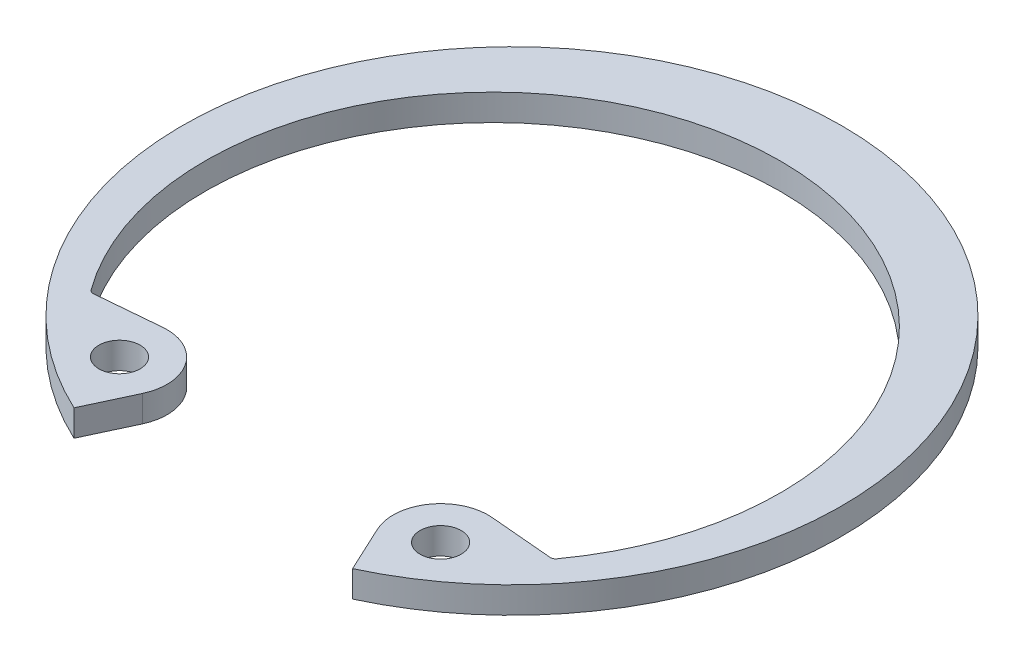
ISO-10303-21;
HEADER;
FILE_DESCRIPTION(('STEP AP214'),'2;1');
FILE_NAME('part.step','',(''),(''),'','','');
FILE_SCHEMA(('AUTOMOTIVE_DESIGN { 1 0 10303 214 1 1 1 1 }'));
ENDSEC;
DATA;
#1=APPLICATION_CONTEXT('core data for automotive mechanical design processes');
#2=APPLICATION_PROTOCOL_DEFINITION('international standard','automotive_design',2000,#1);
#3=PRODUCT_CONTEXT('',#1,'mechanical');
#4=PRODUCT('Part','Part','',(#3));
#5=PRODUCT_RELATED_PRODUCT_CATEGORY('part','',(#4));
#6=PRODUCT_DEFINITION_FORMATION('','',#4);
#7=PRODUCT_DEFINITION_CONTEXT('part definition',#1,'design');
#8=PRODUCT_DEFINITION('design','',#6,#7);
#9=PRODUCT_DEFINITION_SHAPE('','',#8);
#10=(LENGTH_UNIT() NAMED_UNIT(*) SI_UNIT(.MILLI.,.METRE.));
#11=(NAMED_UNIT(*) PLANE_ANGLE_UNIT() SI_UNIT($,.RADIAN.));
#12=(NAMED_UNIT(*) SI_UNIT($,.STERADIAN.) SOLID_ANGLE_UNIT());
#13=UNCERTAINTY_MEASURE_WITH_UNIT(LENGTH_MEASURE(1.E-05),#10,'distance_accuracy_value','');
#14=(GEOMETRIC_REPRESENTATION_CONTEXT(3) GLOBAL_UNCERTAINTY_ASSIGNED_CONTEXT((#13)) GLOBAL_UNIT_ASSIGNED_CONTEXT((#10,
#11,#12)) REPRESENTATION_CONTEXT('',''));
#15=CARTESIAN_POINT('',(0.,0.,0.));
#16=DIRECTION('',(0.,0.,1.));
#17=DIRECTION('',(1.,0.,0.));
#18=AXIS2_PLACEMENT_3D('',#15,#16,#17);
#19=CARTESIAN_POINT('',(7.72748984788551,-1.27,11.1625186378714));
#20=DIRECTION('',(0.,1.,0.));
#21=DIRECTION('',(0.,0.,1.));
#22=AXIS2_PLACEMENT_3D('',#19,#20,#21);
#23=CYLINDRICAL_SURFACE('',#22,2.28599999999999);
#24=CARTESIAN_POINT('',(7.72748984788551,0.,11.1625186378714));
#25=DIRECTION('',(0.,1.,0.));
#26=DIRECTION('',(0.,0.,-1.));
#27=AXIS2_PLACEMENT_3D('',#24,#25,#26);
#28=CIRCLE('',#27,2.28599999999999);
#29=CARTESIAN_POINT('',(7.92672787580667,0.,8.88521755803369));
#30=VERTEX_POINT('',#29);
#31=CARTESIAN_POINT('',(5.65567024671972,0.,12.1286239842106));
#32=VERTEX_POINT('',#31);
#33=EDGE_CURVE('E143',#30,#32,#28,.T.);
#34=ORIENTED_EDGE('',*,*,#33,.F.);
#35=DIRECTION('',(0.,1.,0.));
#36=VECTOR('',#35,1.);
#37=CARTESIAN_POINT('',(7.92672787580667,-1.27,8.88521755803369));
#38=LINE('',#37,#36);
#39=CARTESIAN_POINT('',(7.92672787580667,-1.27,8.88521755803369));
#40=VERTEX_POINT('',#39);
#41=EDGE_CURVE('E219',#40,#30,#38,.T.);
#42=ORIENTED_EDGE('',*,*,#41,.F.);
#43=CARTESIAN_POINT('',(7.72748984788551,-1.27,11.1625186378714));
#44=DIRECTION('',(0.,1.,0.));
#45=DIRECTION('',(0.,0.,-1.));
#46=AXIS2_PLACEMENT_3D('',#43,#44,#45);
#47=CIRCLE('',#46,2.28599999999999);
#48=CARTESIAN_POINT('',(5.65567024671972,-1.27,12.1286239842106));
#49=VERTEX_POINT('',#48);
#50=EDGE_CURVE('E145',#40,#49,#47,.T.);
#51=ORIENTED_EDGE('',*,*,#50,.T.);
#52=DIRECTION('',(0.,1.,0.));
#53=VECTOR('',#52,1.);
#54=CARTESIAN_POINT('',(5.65567024671972,-1.27,12.1286239842106));
#55=LINE('',#54,#53);
#56=EDGE_CURVE('E139',#49,#32,#55,.T.);
#57=ORIENTED_EDGE('',*,*,#56,.T.);
#58=EDGE_LOOP('',(#34,#42,#51,#57));
#59=FACE_BOUND('',#58,.T.);
#60=ADVANCED_FACE('F44',(#59),#23,.T.);
#61=CARTESIAN_POINT('',(11.1256040131855,-1.27,9.16508295607794));
#62=DIRECTION('',(0.08715574274766,0.,-0.996194698091745));
#63=DIRECTION('',(-0.996194698091746,0.,-0.08715574274766));
#64=AXIS2_PLACEMENT_3D('',#61,#62,#63);
#65=PLANE('',#64);
#66=DIRECTION('',(-0.996194698091745,0.,-0.08715574274766));
#67=VECTOR('',#66,1.);
#68=CARTESIAN_POINT('',(11.1256040131855,0.,9.16508295607794));
#69=LINE('',#68,#67);
#70=CARTESIAN_POINT('',(10.983084144875,0.,9.15261408327356));
#71=VERTEX_POINT('',#70);
#72=EDGE_CURVE('E162',#71,#30,#69,.T.);
#73=ORIENTED_EDGE('',*,*,#72,.F.);
#74=DIRECTION('',(0.,-1.,0.));
#75=VECTOR('',#74,1.);
#76=CARTESIAN_POINT('',(10.983084144875,-1.27,9.15261408327356));
#77=LINE('',#76,#75);
#78=CARTESIAN_POINT('',(10.983084144875,-1.27,9.15261408327356));
#79=VERTEX_POINT('',#78);
#80=EDGE_CURVE('E62',#71,#79,#77,.T.);
#81=ORIENTED_EDGE('',*,*,#80,.T.);
#82=DIRECTION('',(-0.996194698091745,0.,-0.08715574274766));
#83=VECTOR('',#82,1.);
#84=CARTESIAN_POINT('',(11.1256040131855,-1.27,9.16508295607794));
#85=LINE('',#84,#83);
#86=EDGE_CURVE('E151',#79,#40,#85,.T.);
#87=ORIENTED_EDGE('',*,*,#86,.T.);
#88=ORIENTED_EDGE('',*,*,#41,.T.);
#89=EDGE_LOOP('',(#73,#81,#87,#88));
#90=FACE_BOUND('',#89,.T.);
#91=ADVANCED_FACE('F282',(#90),#65,.T.);
#92=CARTESIAN_POINT('',(0.,-1.27,0.927434650927232));
#93=DIRECTION('',(0.,1.,0.));
#94=DIRECTION('',(0.,0.,1.));
#95=AXIS2_PLACEMENT_3D('',#92,#93,#94);
#96=CYLINDRICAL_SURFACE('',#95,13.8433346509272);
#97=CARTESIAN_POINT('',(0.,0.,0.927434650927232));
#98=DIRECTION('',(0.,-1.,0.));
#99=DIRECTION('',(0.,0.,1.));
#100=AXIS2_PLACEMENT_3D('',#97,#98,#99);
#101=CIRCLE('',#100,13.8433346509272);
#102=CARTESIAN_POINT('',(-11.2109217164107,0.,9.04858903476162));
#103=VERTEX_POINT('',#102);
#104=CARTESIAN_POINT('',(11.2109217164107,0.,9.04858903476163));
#105=VERTEX_POINT('',#104);
#106=EDGE_CURVE('E187',#103,#105,#101,.T.);
#107=ORIENTED_EDGE('',*,*,#106,.F.);
#108=DIRECTION('',(0.,1.,0.));
#109=VECTOR('',#108,1.);
#110=CARTESIAN_POINT('',(-11.2109217164107,-1.27,9.04858903476162));
#111=LINE('',#110,#109);
#112=CARTESIAN_POINT('',(-11.2109217164107,-1.27,9.04858903476162));
#113=VERTEX_POINT('',#112);
#114=EDGE_CURVE('E241',#103,#113,#111,.F.);
#115=ORIENTED_EDGE('',*,*,#114,.T.);
#116=CARTESIAN_POINT('',(0.,-1.27,0.927434650927232));
#117=DIRECTION('',(0.,-1.,0.));
#118=DIRECTION('',(0.,0.,1.));
#119=AXIS2_PLACEMENT_3D('',#116,#117,#118);
#120=CIRCLE('',#119,13.8433346509272);
#121=CARTESIAN_POINT('',(11.2109217164107,-1.27,9.04858903476163));
#122=VERTEX_POINT('',#121);
#123=EDGE_CURVE('E213',#113,#122,#120,.T.);
#124=ORIENTED_EDGE('',*,*,#123,.T.);
#125=DIRECTION('',(0.,1.,0.));
#126=VECTOR('',#125,1.);
#127=CARTESIAN_POINT('',(11.2109217164107,-1.27,9.04858903476163));
#128=LINE('',#127,#126);
#129=EDGE_CURVE('E237',#122,#105,#128,.T.);
#130=ORIENTED_EDGE('',*,*,#129,.T.);
#131=EDGE_LOOP('',(#107,#115,#124,#130));
#132=FACE_BOUND('',#131,.T.);
#133=ADVANCED_FACE('F286',(#132),#96,.F.);
#134=CARTESIAN_POINT('',(-11.1256040131855,-1.27,9.16508295607793));
#135=DIRECTION('',(-0.08715574274766,0.,-0.996194698091745));
#136=DIRECTION('',(-0.996194698091746,0.,0.08715574274766));
#137=AXIS2_PLACEMENT_3D('',#134,#135,#136);
#138=PLANE('',#137);
#139=DIRECTION('',(-0.996194698091745,0.,0.08715574274766));
#140=VECTOR('',#139,1.);
#141=CARTESIAN_POINT('',(-11.1256040131855,-1.27,9.16508295607793));
#142=LINE('',#141,#140);
#143=CARTESIAN_POINT('',(-7.92672787580665,-1.27,8.88521755803368));
#144=VERTEX_POINT('',#143);
#145=CARTESIAN_POINT('',(-10.983084144875,-1.27,9.15261408327355));
#146=VERTEX_POINT('',#145);
#147=EDGE_CURVE('E209',#144,#146,#142,.T.);
#148=ORIENTED_EDGE('',*,*,#147,.T.);
#149=DIRECTION('',(0.,-1.,0.));
#150=VECTOR('',#149,1.);
#151=CARTESIAN_POINT('',(-10.983084144875,0.,9.15261408327355));
#152=LINE('',#151,#150);
#153=CARTESIAN_POINT('',(-10.983084144875,0.,9.15261408327355));
#154=VERTEX_POINT('',#153);
#155=EDGE_CURVE('E222',#146,#154,#152,.F.);
#156=ORIENTED_EDGE('',*,*,#155,.T.);
#157=DIRECTION('',(-0.996194698091745,0.,0.08715574274766));
#158=VECTOR('',#157,1.);
#159=CARTESIAN_POINT('',(-11.1256040131855,0.,9.16508295607793));
#160=LINE('',#159,#158);
#161=CARTESIAN_POINT('',(-7.92672787580665,0.,8.88521755803368));
#162=VERTEX_POINT('',#161);
#163=EDGE_CURVE('E183',#162,#154,#160,.T.);
#164=ORIENTED_EDGE('',*,*,#163,.F.);
#165=DIRECTION('',(0.,1.,0.));
#166=VECTOR('',#165,1.);
#167=CARTESIAN_POINT('',(-7.92672787580665,-1.27,8.88521755803368));
#168=LINE('',#167,#166);
#169=EDGE_CURVE('E223',#144,#162,#168,.T.);
#170=ORIENTED_EDGE('',*,*,#169,.F.);
#171=EDGE_LOOP('',(#148,#156,#164,#170));
#172=FACE_BOUND('',#171,.T.);
#173=ADVANCED_FACE('F291',(#172),#138,.T.);
#174=CARTESIAN_POINT('',(-7.72748984788551,-1.27,11.1625186378714));
#175=DIRECTION('',(0.,1.,0.));
#176=DIRECTION('',(0.,0.,1.));
#177=AXIS2_PLACEMENT_3D('',#174,#175,#176);
#178=CYLINDRICAL_SURFACE('',#177,2.286);
#179=CARTESIAN_POINT('',(-7.72748984788551,0.,11.1625186378714));
#180=DIRECTION('',(0.,1.,0.));
#181=DIRECTION('',(0.,0.,1.));
#182=AXIS2_PLACEMENT_3D('',#179,#180,#181);
#183=CIRCLE('',#182,2.286);
#184=CARTESIAN_POINT('',(-5.65567024671972,0.,12.1286239842106));
#185=VERTEX_POINT('',#184);
#186=EDGE_CURVE('E179',#185,#162,#183,.T.);
#187=ORIENTED_EDGE('',*,*,#186,.F.);
#188=DIRECTION('',(0.,1.,0.));
#189=VECTOR('',#188,1.);
#190=CARTESIAN_POINT('',(-5.65567024671972,-1.27,12.1286239842106));
#191=LINE('',#190,#189);
#192=CARTESIAN_POINT('',(-5.65567024671972,-1.27,12.1286239842106));
#193=VERTEX_POINT('',#192);
#194=EDGE_CURVE('E226',#193,#185,#191,.T.);
#195=ORIENTED_EDGE('',*,*,#194,.F.);
#196=CARTESIAN_POINT('',(-7.72748984788551,-1.27,11.1625186378714));
#197=DIRECTION('',(0.,1.,0.));
#198=DIRECTION('',(0.,0.,1.));
#199=AXIS2_PLACEMENT_3D('',#196,#197,#198);
#200=CIRCLE('',#199,2.286);
#201=EDGE_CURVE('E205',#193,#144,#200,.T.);
#202=ORIENTED_EDGE('',*,*,#201,.T.);
#203=ORIENTED_EDGE('',*,*,#169,.T.);
#204=EDGE_LOOP('',(#187,#195,#202,#203));
#205=FACE_BOUND('',#204,.T.);
#206=ADVANCED_FACE('F297',(#205),#178,.T.);
#207=CARTESIAN_POINT('',(-6.70369765320941,-1.27,14.3761260103115));
#208=DIRECTION('',(0.906307787036652,0.,0.422618261740694));
#209=DIRECTION('',(0.422618261740694,0.,-0.906307787036652));
#210=AXIS2_PLACEMENT_3D('',#207,#208,#209);
#211=PLANE('',#210);
#212=DIRECTION('',(0.422618261740694,0.,-0.906307787036652));
#213=VECTOR('',#212,1.);
#214=CARTESIAN_POINT('',(-6.70369765320941,0.,14.3761260103115));
#215=LINE('',#214,#213);
#216=CARTESIAN_POINT('',(-6.70369765320942,0.,14.3761260103115));
#217=VERTEX_POINT('',#216);
#218=EDGE_CURVE('E175',#217,#185,#215,.T.);
#219=ORIENTED_EDGE('',*,*,#218,.F.);
#220=DIRECTION('',(0.,1.,0.));
#221=VECTOR('',#220,1.);
#222=CARTESIAN_POINT('',(-6.70369765320942,-1.27,14.3761260103115));
#223=LINE('',#222,#221);
#224=CARTESIAN_POINT('',(-6.70369765320942,-1.27,14.3761260103115));
#225=VERTEX_POINT('',#224);
#226=EDGE_CURVE('E229',#225,#217,#223,.T.);
#227=ORIENTED_EDGE('',*,*,#226,.F.);
#228=DIRECTION('',(0.422618261740694,0.,-0.906307787036652));
#229=VECTOR('',#228,1.);
#230=CARTESIAN_POINT('',(-6.70369765320941,-1.27,14.3761260103115));
#231=LINE('',#230,#229);
#232=EDGE_CURVE('E201',#225,#193,#231,.T.);
#233=ORIENTED_EDGE('',*,*,#232,.T.);
#234=ORIENTED_EDGE('',*,*,#194,.T.);
#235=EDGE_LOOP('',(#219,#227,#233,#234));
#236=FACE_BOUND('',#235,.T.);
#237=ADVANCED_FACE('F301',(#236),#211,.T.);
#238=CARTESIAN_POINT('',(0.,-1.27,0.));
#239=DIRECTION('',(0.,1.,0.));
#240=DIRECTION('',(0.,0.,1.));
#241=AXIS2_PLACEMENT_3D('',#238,#239,#240);
#242=CYLINDRICAL_SURFACE('',#241,15.8623);
#243=CARTESIAN_POINT('',(0.,0.,0.));
#244=DIRECTION('',(0.,1.,0.));
#245=DIRECTION('',(0.,0.,1.));
#246=AXIS2_PLACEMENT_3D('',#243,#244,#245);
#247=CIRCLE('',#246,15.8623);
#248=CARTESIAN_POINT('',(6.70369765320941,0.,14.3761260103115));
#249=VERTEX_POINT('',#248);
#250=EDGE_CURVE('E159',#249,#217,#247,.T.);
#251=ORIENTED_EDGE('',*,*,#250,.F.);
#252=DIRECTION('',(0.,1.,0.));
#253=VECTOR('',#252,1.);
#254=CARTESIAN_POINT('',(6.70369765320941,-1.27,14.3761260103115));
#255=LINE('',#254,#253);
#256=CARTESIAN_POINT('',(6.70369765320941,-1.27,14.3761260103115));
#257=VERTEX_POINT('',#256);
#258=EDGE_CURVE('E150',#257,#249,#255,.T.);
#259=ORIENTED_EDGE('',*,*,#258,.F.);
#260=CARTESIAN_POINT('',(0.,-1.27,0.));
#261=DIRECTION('',(0.,1.,0.));
#262=DIRECTION('',(0.,0.,1.));
#263=AXIS2_PLACEMENT_3D('',#260,#261,#262);
#264=CIRCLE('',#263,15.8623);
#265=EDGE_CURVE('E197',#257,#225,#264,.T.);
#266=ORIENTED_EDGE('',*,*,#265,.T.);
#267=ORIENTED_EDGE('',*,*,#226,.T.);
#268=EDGE_LOOP('',(#251,#259,#266,#267));
#269=FACE_BOUND('',#268,.T.);
#270=ADVANCED_FACE('F305',(#269),#242,.T.);
#271=CARTESIAN_POINT('',(6.70369765320941,-1.27,14.3761260103115));
#272=DIRECTION('',(-0.906307787036652,0.,0.422618261740694));
#273=DIRECTION('',(0.422618261740694,0.,0.906307787036652));
#274=AXIS2_PLACEMENT_3D('',#271,#272,#273);
#275=PLANE('',#274);
#276=DIRECTION('',(0.422618261740694,0.,0.906307787036652));
#277=VECTOR('',#276,1.);
#278=CARTESIAN_POINT('',(6.70369765320941,0.,14.3761260103115));
#279=LINE('',#278,#277);
#280=EDGE_CURVE('E154',#32,#249,#279,.T.);
#281=ORIENTED_EDGE('',*,*,#280,.F.);
#282=ORIENTED_EDGE('',*,*,#56,.F.);
#283=DIRECTION('',(0.422618261740694,0.,0.906307787036652));
#284=VECTOR('',#283,1.);
#285=CARTESIAN_POINT('',(6.70369765320941,-1.27,14.3761260103115));
#286=LINE('',#285,#284);
#287=EDGE_CURVE('E194',#49,#257,#286,.T.);
#288=ORIENTED_EDGE('',*,*,#287,.T.);
#289=ORIENTED_EDGE('',*,*,#258,.T.);
#290=EDGE_LOOP('',(#281,#282,#288,#289));
#291=FACE_BOUND('',#290,.T.);
#292=ADVANCED_FACE('F155',(#291),#275,.T.);
#293=CARTESIAN_POINT('',(7.72748984788551,-1.27,11.1625186378714));
#294=DIRECTION('',(0.,-1.,0.));
#295=DIRECTION('',(0.,0.,-1.));
#296=AXIS2_PLACEMENT_3D('',#293,#294,#295);
#297=PLANE('',#296);
#298=CARTESIAN_POINT('',(-7.72748984788551,-1.27,11.1625186378714));
#299=DIRECTION('',(0.,1.,0.));
#300=DIRECTION('',(0.,0.,1.));
#301=AXIS2_PLACEMENT_3D('',#298,#299,#300);
#302=CIRCLE('',#301,0.990599999999999);
#303=CARTESIAN_POINT('',(-7.72748984788551,-1.27,12.1531186378714));
#304=VERTEX_POINT('',#303);
#305=EDGE_CURVE('E255',#304,#304,#302,.T.);
#306=ORIENTED_EDGE('',*,*,#305,.T.);
#307=EDGE_LOOP('',(#306));
#308=FACE_BOUND('',#307,.T.);
#309=CARTESIAN_POINT('',(7.7274898478855,-1.27,11.1625186378714));
#310=DIRECTION('',(0.,1.,0.));
#311=DIRECTION('',(0.,0.,1.));
#312=AXIS2_PLACEMENT_3D('',#309,#310,#311);
#313=CIRCLE('',#312,0.990599999999999);
#314=CARTESIAN_POINT('',(7.7274898478855,-1.27,12.1531186378714));
#315=VERTEX_POINT('',#314);
#316=EDGE_CURVE('E165',#315,#315,#313,.T.);
#317=ORIENTED_EDGE('',*,*,#316,.T.);
#318=EDGE_LOOP('',(#317));
#319=FACE_BOUND('',#318,.T.);
#320=ORIENTED_EDGE('',*,*,#50,.F.);
#321=ORIENTED_EDGE('',*,*,#86,.F.);
#322=CARTESIAN_POINT('',(11.0052217035329,-1.27,8.89958062995826));
#323=DIRECTION('',(0.,-1.,0.));
#324=DIRECTION('',(0.,0.,-1.));
#325=AXIS2_PLACEMENT_3D('',#322,#323,#324);
#326=CIRCLE('',#325,0.254);
#327=EDGE_CURVE('E11',#79,#122,#326,.F.);
#328=ORIENTED_EDGE('',*,*,#327,.T.);
#329=ORIENTED_EDGE('',*,*,#123,.F.);
#330=CARTESIAN_POINT('',(-11.0052217035329,-1.27,8.89958062995824));
#331=DIRECTION('',(0.,-1.,0.));
#332=DIRECTION('',(0.,0.,-1.));
#333=AXIS2_PLACEMENT_3D('',#330,#331,#332);
#334=CIRCLE('',#333,0.254);
#335=EDGE_CURVE('E249',#113,#146,#334,.F.);
#336=ORIENTED_EDGE('',*,*,#335,.T.);
#337=ORIENTED_EDGE('',*,*,#147,.F.);
#338=ORIENTED_EDGE('',*,*,#201,.F.);
#339=ORIENTED_EDGE('',*,*,#232,.F.);
#340=ORIENTED_EDGE('',*,*,#265,.F.);
#341=ORIENTED_EDGE('',*,*,#287,.F.);
#342=EDGE_LOOP('',(#320,#321,#328,#329,#336,#337,#338,#339,#340,#341));
#343=FACE_BOUND('',#342,.T.);
#344=ADVANCED_FACE('F269',(#308,#319,#343),#297,.T.);
#345=CARTESIAN_POINT('',(7.72748984788551,0.,11.1625186378714));
#346=DIRECTION('',(0.,-1.,0.));
#347=DIRECTION('',(0.,0.,-1.));
#348=AXIS2_PLACEMENT_3D('',#345,#346,#347);
#349=PLANE('',#348);
#350=CARTESIAN_POINT('',(-7.72748984788551,0.,11.1625186378714));
#351=DIRECTION('',(0.,1.,0.));
#352=DIRECTION('',(0.,0.,1.));
#353=AXIS2_PLACEMENT_3D('',#350,#351,#352);
#354=CIRCLE('',#353,0.990599999999999);
#355=CARTESIAN_POINT('',(-7.72748984788551,0.,12.1531186378714));
#356=VERTEX_POINT('',#355);
#357=EDGE_CURVE('E253',#356,#356,#354,.T.);
#358=ORIENTED_EDGE('',*,*,#357,.F.);
#359=EDGE_LOOP('',(#358));
#360=FACE_BOUND('',#359,.T.);
#361=CARTESIAN_POINT('',(7.7274898478855,0.,11.1625186378714));
#362=DIRECTION('',(0.,1.,0.));
#363=DIRECTION('',(0.,0.,1.));
#364=AXIS2_PLACEMENT_3D('',#361,#362,#363);
#365=CIRCLE('',#364,0.990599999999999);
#366=CARTESIAN_POINT('',(7.7274898478855,0.,12.1531186378714));
#367=VERTEX_POINT('',#366);
#368=EDGE_CURVE('E169',#367,#367,#365,.T.);
#369=ORIENTED_EDGE('',*,*,#368,.F.);
#370=EDGE_LOOP('',(#369));
#371=FACE_BOUND('',#370,.T.);
#372=ORIENTED_EDGE('',*,*,#33,.T.);
#373=ORIENTED_EDGE('',*,*,#280,.T.);
#374=ORIENTED_EDGE('',*,*,#250,.T.);
#375=ORIENTED_EDGE('',*,*,#218,.T.);
#376=ORIENTED_EDGE('',*,*,#186,.T.);
#377=ORIENTED_EDGE('',*,*,#163,.T.);
#378=CARTESIAN_POINT('',(-11.0052217035329,0.,8.89958062995824));
#379=DIRECTION('',(0.,-1.,0.));
#380=DIRECTION('',(0.,0.,-1.));
#381=AXIS2_PLACEMENT_3D('',#378,#379,#380);
#382=CIRCLE('',#381,0.254);
#383=EDGE_CURVE('E246',#154,#103,#382,.T.);
#384=ORIENTED_EDGE('',*,*,#383,.T.);
#385=ORIENTED_EDGE('',*,*,#106,.T.);
#386=CARTESIAN_POINT('',(11.0052217035329,0.,8.89958062995826));
#387=DIRECTION('',(0.,-1.,0.));
#388=DIRECTION('',(0.,0.,-1.));
#389=AXIS2_PLACEMENT_3D('',#386,#387,#388);
#390=CIRCLE('',#389,0.254);
#391=EDGE_CURVE('E52',#105,#71,#390,.T.);
#392=ORIENTED_EDGE('',*,*,#391,.T.);
#393=ORIENTED_EDGE('',*,*,#72,.T.);
#394=EDGE_LOOP('',(#372,#373,#374,#375,#376,#377,#384,#385,#392,#393));
#395=FACE_BOUND('',#394,.T.);
#396=ADVANCED_FACE('F161',(#360,#371,#395),#349,.F.);
#397=CARTESIAN_POINT('',(7.7274898478855,-1.27,11.1625186378714));
#398=DIRECTION('',(0.,1.,0.));
#399=DIRECTION('',(0.,0.,1.));
#400=AXIS2_PLACEMENT_3D('',#397,#398,#399);
#401=CYLINDRICAL_SURFACE('',#400,0.990599999999999);
#402=ORIENTED_EDGE('',*,*,#316,.F.);
#403=EDGE_LOOP('',(#402));
#404=FACE_BOUND('',#403,.T.);
#405=ORIENTED_EDGE('',*,*,#368,.T.);
#406=EDGE_LOOP('',(#405));
#407=FACE_BOUND('',#406,.T.);
#408=ADVANCED_FACE('F266',(#404,#407),#401,.F.);
#409=CARTESIAN_POINT('',(-7.72748984788551,-1.27,11.1625186378714));
#410=DIRECTION('',(0.,1.,0.));
#411=DIRECTION('',(0.,0.,1.));
#412=AXIS2_PLACEMENT_3D('',#409,#410,#411);
#413=CYLINDRICAL_SURFACE('',#412,0.990599999999999);
#414=ORIENTED_EDGE('',*,*,#305,.F.);
#415=EDGE_LOOP('',(#414));
#416=FACE_BOUND('',#415,.T.);
#417=ORIENTED_EDGE('',*,*,#357,.T.);
#418=EDGE_LOOP('',(#417));
#419=FACE_BOUND('',#418,.T.);
#420=ADVANCED_FACE('F276',(#416,#419),#413,.F.);
#421=CARTESIAN_POINT('',(-11.0052217035329,-1.27,8.89958062995824));
#422=DIRECTION('',(0.,1.,0.));
#423=DIRECTION('',(0.,0.,1.));
#424=AXIS2_PLACEMENT_3D('',#421,#422,#423);
#425=CYLINDRICAL_SURFACE('',#424,0.254);
#426=ORIENTED_EDGE('',*,*,#335,.F.);
#427=ORIENTED_EDGE('',*,*,#114,.F.);
#428=ORIENTED_EDGE('',*,*,#383,.F.);
#429=ORIENTED_EDGE('',*,*,#155,.F.);
#430=EDGE_LOOP('',(#426,#427,#428,#429));
#431=FACE_BOUND('',#430,.T.);
#432=ADVANCED_FACE('F399',(#431),#425,.F.);
#433=CARTESIAN_POINT('',(11.0052217035329,-1.27,8.89958062995826));
#434=DIRECTION('',(0.,1.,0.));
#435=DIRECTION('',(0.,0.,1.));
#436=AXIS2_PLACEMENT_3D('',#433,#434,#435);
#437=CYLINDRICAL_SURFACE('',#436,0.254);
#438=ORIENTED_EDGE('',*,*,#327,.F.);
#439=ORIENTED_EDGE('',*,*,#80,.F.);
#440=ORIENTED_EDGE('',*,*,#391,.F.);
#441=ORIENTED_EDGE('',*,*,#129,.F.);
#442=EDGE_LOOP('',(#438,#439,#440,#441));
#443=FACE_BOUND('',#442,.T.);
#444=ADVANCED_FACE('F407',(#443),#437,.F.);
#445=CLOSED_SHELL('',(#60,#91,#133,#173,#206,#237,#270,#292,#344,#396,#408,#420,#432,#444));
#446=MANIFOLD_SOLID_BREP('B2',#445);
#447=ADVANCED_BREP_SHAPE_REPRESENTATION('',(#18,#446),#14);
#448=SHAPE_DEFINITION_REPRESENTATION(#9,#447);
ENDSEC;
END-ISO-10303-21;
